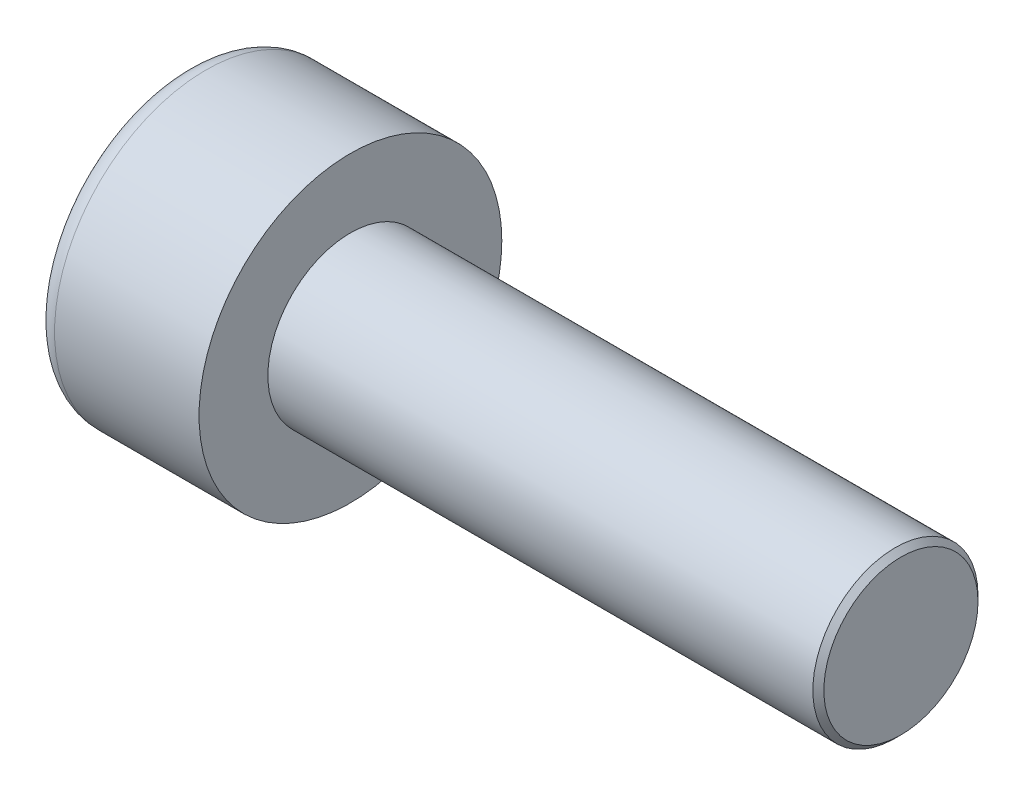
ISO-10303-21;
HEADER;
FILE_DESCRIPTION(('STEP AP214'),'2;1');
FILE_NAME('part.step','',(''),(''),'','','');
FILE_SCHEMA(('AUTOMOTIVE_DESIGN { 1 0 10303 214 1 1 1 1 }'));
ENDSEC;
DATA;
#1=APPLICATION_CONTEXT('core data for automotive mechanical design processes');
#2=APPLICATION_PROTOCOL_DEFINITION('international standard','automotive_design',2000,#1);
#3=PRODUCT_CONTEXT('',#1,'mechanical');
#4=PRODUCT('Part','Part','',(#3));
#5=PRODUCT_RELATED_PRODUCT_CATEGORY('part','',(#4));
#6=PRODUCT_DEFINITION_FORMATION('','',#4);
#7=PRODUCT_DEFINITION_CONTEXT('part definition',#1,'design');
#8=PRODUCT_DEFINITION('design','',#6,#7);
#9=PRODUCT_DEFINITION_SHAPE('','',#8);
#10=(LENGTH_UNIT() NAMED_UNIT(*) SI_UNIT(.MILLI.,.METRE.));
#11=(NAMED_UNIT(*) PLANE_ANGLE_UNIT() SI_UNIT($,.RADIAN.));
#12=(NAMED_UNIT(*) SI_UNIT($,.STERADIAN.) SOLID_ANGLE_UNIT());
#13=UNCERTAINTY_MEASURE_WITH_UNIT(LENGTH_MEASURE(1.E-05),#10,'distance_accuracy_value','');
#14=(GEOMETRIC_REPRESENTATION_CONTEXT(3) GLOBAL_UNCERTAINTY_ASSIGNED_CONTEXT((#13)) GLOBAL_UNIT_ASSIGNED_CONTEXT((#10,
#11,#12)) REPRESENTATION_CONTEXT('',''));
#15=CARTESIAN_POINT('',(0.,0.,0.));
#16=DIRECTION('',(0.,0.,1.));
#17=DIRECTION('',(1.,0.,0.));
#18=AXIS2_PLACEMENT_3D('',#15,#16,#17);
#19=CARTESIAN_POINT('',(1.3,-2.5,0.));
#20=DIRECTION('',(-1.,0.,0.));
#21=DIRECTION('',(0.,0.,1.));
#22=AXIS2_PLACEMENT_3D('',#19,#20,#21);
#23=PLANE('',#22);
#24=DIRECTION('',(0.,-0.866025403784438,-0.5));
#25=VECTOR('',#24,1.);
#26=CARTESIAN_POINT('',(1.3,0.,1.44337567297406));
#27=LINE('',#26,#25);
#28=CARTESIAN_POINT('',(1.3,-0.625,1.08253175473055));
#29=VERTEX_POINT('',#28);
#30=CARTESIAN_POINT('',(1.3,-1.25,0.721687836487032));
#31=VERTEX_POINT('',#30);
#32=EDGE_CURVE('E157',#29,#31,#27,.T.);
#33=ORIENTED_EDGE('',*,*,#32,.F.);
#34=CARTESIAN_POINT('',(1.3,0.,0.));
#35=DIRECTION('',(-1.,0.,0.));
#36=DIRECTION('',(0.,0.,1.));
#37=AXIS2_PLACEMENT_3D('',#34,#35,#36);
#38=CIRCLE('',#37,1.25);
#39=CARTESIAN_POINT('',(1.3,-1.25,0.));
#40=VERTEX_POINT('',#39);
#41=EDGE_CURVE('E52',#29,#40,#38,.F.);
#42=ORIENTED_EDGE('',*,*,#41,.T.);
#43=DIRECTION('',(0.,0.,-1.));
#44=VECTOR('',#43,1.);
#45=CARTESIAN_POINT('',(1.3,-1.25,0.721687836487032));
#46=LINE('',#45,#44);
#47=EDGE_CURVE('E162',#31,#40,#46,.T.);
#48=ORIENTED_EDGE('',*,*,#47,.F.);
#49=EDGE_LOOP('',(#33,#42,#48));
#50=FACE_BOUND('',#49,.T.);
#51=ADVANCED_FACE('F37',(#50),#23,.T.);
#52=CARTESIAN_POINT('',(1.3,-1.25,-0.721687836487033));
#53=VERTEX_POINT('',#52);
#54=EDGE_CURVE('E161',#40,#53,#46,.T.);
#55=ORIENTED_EDGE('',*,*,#54,.F.);
#56=CARTESIAN_POINT('',(1.3,-0.624999999999999,-1.08253175473055));
#57=VERTEX_POINT('',#56);
#58=EDGE_CURVE('E137',#40,#57,#38,.F.);
#59=ORIENTED_EDGE('',*,*,#58,.T.);
#60=DIRECTION('',(0.,0.866025403784438,-0.5));
#61=VECTOR('',#60,1.);
#62=CARTESIAN_POINT('',(1.3,-1.25,-0.721687836487033));
#63=LINE('',#62,#61);
#64=EDGE_CURVE('E145',#53,#57,#63,.T.);
#65=ORIENTED_EDGE('',*,*,#64,.F.);
#66=EDGE_LOOP('',(#55,#59,#65));
#67=FACE_BOUND('',#66,.T.);
#68=ADVANCED_FACE('F218',(#67),#23,.T.);
#69=CARTESIAN_POINT('',(1.3,0.,-1.44337567297406));
#70=VERTEX_POINT('',#69);
#71=EDGE_CURVE('E135',#57,#70,#63,.T.);
#72=ORIENTED_EDGE('',*,*,#71,.F.);
#73=CARTESIAN_POINT('',(1.3,0.625,-1.08253175473055));
#74=VERTEX_POINT('',#73);
#75=EDGE_CURVE('E119',#57,#74,#38,.F.);
#76=ORIENTED_EDGE('',*,*,#75,.T.);
#77=DIRECTION('',(0.,0.866025403784438,0.5));
#78=VECTOR('',#77,1.);
#79=CARTESIAN_POINT('',(1.3,0.,-1.44337567297406));
#80=LINE('',#79,#78);
#81=EDGE_CURVE('E133',#70,#74,#80,.T.);
#82=ORIENTED_EDGE('',*,*,#81,.F.);
#83=EDGE_LOOP('',(#72,#76,#82));
#84=FACE_BOUND('',#83,.T.);
#85=ADVANCED_FACE('F131',(#84),#23,.T.);
#86=CARTESIAN_POINT('',(1.3,1.25,-0.721687836487031));
#87=VERTEX_POINT('',#86);
#88=EDGE_CURVE('E139',#74,#87,#80,.T.);
#89=ORIENTED_EDGE('',*,*,#88,.F.);
#90=CARTESIAN_POINT('',(1.3,0.,0.));
#91=DIRECTION('',(1.,0.,0.));
#92=DIRECTION('',(0.,0.,-1.));
#93=AXIS2_PLACEMENT_3D('',#90,#91,#92);
#94=CIRCLE('',#93,1.25);
#95=CARTESIAN_POINT('',(1.3,1.25,0.));
#96=VERTEX_POINT('',#95);
#97=EDGE_CURVE('E117',#74,#96,#94,.T.);
#98=ORIENTED_EDGE('',*,*,#97,.T.);
#99=DIRECTION('',(0.,0.,1.));
#100=VECTOR('',#99,1.);
#101=CARTESIAN_POINT('',(1.3,1.25,-0.721687836487031));
#102=LINE('',#101,#100);
#103=EDGE_CURVE('E142',#87,#96,#102,.T.);
#104=ORIENTED_EDGE('',*,*,#103,.F.);
#105=EDGE_LOOP('',(#89,#98,#104));
#106=FACE_BOUND('',#105,.T.);
#107=ADVANCED_FACE('F140',(#106),#23,.T.);
#108=CARTESIAN_POINT('',(1.3,1.25,0.721687836487032));
#109=VERTEX_POINT('',#108);
#110=EDGE_CURVE('E149',#96,#109,#102,.T.);
#111=ORIENTED_EDGE('',*,*,#110,.F.);
#112=CARTESIAN_POINT('',(1.3,0.625,1.08253175473055));
#113=VERTEX_POINT('',#112);
#114=EDGE_CURVE('E122',#96,#113,#38,.F.);
#115=ORIENTED_EDGE('',*,*,#114,.T.);
#116=DIRECTION('',(0.,-0.866025403784439,0.5));
#117=VECTOR('',#116,1.);
#118=CARTESIAN_POINT('',(1.3,1.25,0.721687836487032));
#119=LINE('',#118,#117);
#120=EDGE_CURVE('E154',#109,#113,#119,.T.);
#121=ORIENTED_EDGE('',*,*,#120,.F.);
#122=EDGE_LOOP('',(#111,#115,#121));
#123=FACE_BOUND('',#122,.T.);
#124=ADVANCED_FACE('F230',(#123),#23,.T.);
#125=CARTESIAN_POINT('',(1.3,0.,1.44337567297406));
#126=VERTEX_POINT('',#125);
#127=EDGE_CURVE('E153',#113,#126,#119,.T.);
#128=ORIENTED_EDGE('',*,*,#127,.F.);
#129=EDGE_CURVE('E198',#113,#29,#38,.F.);
#130=ORIENTED_EDGE('',*,*,#129,.T.);
#131=EDGE_CURVE('E158',#126,#29,#27,.T.);
#132=ORIENTED_EDGE('',*,*,#131,.F.);
#133=EDGE_LOOP('',(#128,#130,#132));
#134=FACE_BOUND('',#133,.T.);
#135=ADVANCED_FACE('F221',(#134),#23,.T.);
#136=CARTESIAN_POINT('',(0.,0.,0.));
#137=DIRECTION('',(1.,0.,0.));
#138=DIRECTION('',(0.,0.,-1.));
#139=AXIS2_PLACEMENT_3D('',#136,#137,#138);
#140=PLANE('',#139);
#141=CARTESIAN_POINT('',(0.,0.,0.));
#142=DIRECTION('',(1.,0.,0.));
#143=DIRECTION('',(0.,0.,-1.));
#144=AXIS2_PLACEMENT_3D('',#141,#142,#143);
#145=CIRCLE('',#144,2.375);
#146=CARTESIAN_POINT('',(0.,0.,-2.375));
#147=VERTEX_POINT('',#146);
#148=EDGE_CURVE('E203',#147,#147,#145,.F.);
#149=ORIENTED_EDGE('',*,*,#148,.T.);
#150=EDGE_LOOP('',(#149));
#151=FACE_BOUND('',#150,.T.);
#152=DIRECTION('',(0.,0.866025403784438,-0.5));
#153=VECTOR('',#152,1.);
#154=CARTESIAN_POINT('',(0.,-1.25,-0.721687836487033));
#155=LINE('',#154,#153);
#156=CARTESIAN_POINT('',(0.,-1.25,-0.721687836487033));
#157=VERTEX_POINT('',#156);
#158=CARTESIAN_POINT('',(0.,0.,-1.44337567297406));
#159=VERTEX_POINT('',#158);
#160=EDGE_CURVE('E60',#157,#159,#155,.T.);
#161=ORIENTED_EDGE('',*,*,#160,.T.);
#162=DIRECTION('',(0.,0.866025403784438,0.5));
#163=VECTOR('',#162,1.);
#164=CARTESIAN_POINT('',(0.,0.,-1.44337567297406));
#165=LINE('',#164,#163);
#166=CARTESIAN_POINT('',(0.,1.25,-0.721687836487031));
#167=VERTEX_POINT('',#166);
#168=EDGE_CURVE('E167',#159,#167,#165,.T.);
#169=ORIENTED_EDGE('',*,*,#168,.T.);
#170=DIRECTION('',(0.,0.,1.));
#171=VECTOR('',#170,1.);
#172=CARTESIAN_POINT('',(0.,1.25,-0.721687836487031));
#173=LINE('',#172,#171);
#174=CARTESIAN_POINT('',(0.,1.25,0.721687836487032));
#175=VERTEX_POINT('',#174);
#176=EDGE_CURVE('E170',#167,#175,#173,.T.);
#177=ORIENTED_EDGE('',*,*,#176,.T.);
#178=DIRECTION('',(0.,-0.866025403784439,0.5));
#179=VECTOR('',#178,1.);
#180=CARTESIAN_POINT('',(0.,1.25,0.721687836487032));
#181=LINE('',#180,#179);
#182=CARTESIAN_POINT('',(0.,0.,1.44337567297406));
#183=VERTEX_POINT('',#182);
#184=EDGE_CURVE('E173',#175,#183,#181,.T.);
#185=ORIENTED_EDGE('',*,*,#184,.T.);
#186=DIRECTION('',(0.,-0.866025403784438,-0.5));
#187=VECTOR('',#186,1.);
#188=CARTESIAN_POINT('',(0.,0.,1.44337567297406));
#189=LINE('',#188,#187);
#190=CARTESIAN_POINT('',(0.,-1.25,0.721687836487032));
#191=VERTEX_POINT('',#190);
#192=EDGE_CURVE('E176',#183,#191,#189,.T.);
#193=ORIENTED_EDGE('',*,*,#192,.T.);
#194=DIRECTION('',(0.,0.,-1.));
#195=VECTOR('',#194,1.);
#196=CARTESIAN_POINT('',(0.,-1.25,0.721687836487032));
#197=LINE('',#196,#195);
#198=EDGE_CURVE('E179',#191,#157,#197,.T.);
#199=ORIENTED_EDGE('',*,*,#198,.T.);
#200=EDGE_LOOP('',(#161,#169,#177,#185,#193,#199));
#201=FACE_BOUND('',#200,.T.);
#202=ADVANCED_FACE('F229',(#151,#201),#140,.F.);
#203=CARTESIAN_POINT('',(3.,0.,0.));
#204=DIRECTION('',(1.,0.,0.));
#205=DIRECTION('',(0.,0.,-1.));
#206=AXIS2_PLACEMENT_3D('',#203,#204,#205);
#207=PLANE('',#206);
#208=CARTESIAN_POINT('',(3.,0.,0.));
#209=DIRECTION('',(1.,0.,0.));
#210=DIRECTION('',(0.,0.,-1.));
#211=AXIS2_PLACEMENT_3D('',#208,#209,#210);
#212=CIRCLE('',#211,2.75);
#213=CARTESIAN_POINT('',(3.,0.,-2.75));
#214=VERTEX_POINT('',#213);
#215=EDGE_CURVE('E195',#214,#214,#212,.T.);
#216=ORIENTED_EDGE('',*,*,#215,.T.);
#217=EDGE_LOOP('',(#216));
#218=FACE_BOUND('',#217,.T.);
#219=CARTESIAN_POINT('',(3.,0.,0.));
#220=DIRECTION('',(1.,0.,0.));
#221=DIRECTION('',(0.,0.,-1.));
#222=AXIS2_PLACEMENT_3D('',#219,#220,#221);
#223=CIRCLE('',#222,1.5);
#224=CARTESIAN_POINT('',(3.,0.,-1.5));
#225=VERTEX_POINT('',#224);
#226=EDGE_CURVE('E192',#225,#225,#223,.T.);
#227=ORIENTED_EDGE('',*,*,#226,.F.);
#228=EDGE_LOOP('',(#227));
#229=FACE_BOUND('',#228,.T.);
#230=ADVANCED_FACE('F236',(#218,#229),#207,.T.);
#231=CARTESIAN_POINT('',(3.,0.,0.));
#232=DIRECTION('',(-1.,0.,0.));
#233=DIRECTION('',(0.,0.,1.));
#234=AXIS2_PLACEMENT_3D('',#231,#232,#233);
#235=CYLINDRICAL_SURFACE('',#234,2.75);
#236=CARTESIAN_POINT('',(0.375,0.,0.));
#237=DIRECTION('',(1.,0.,0.));
#238=DIRECTION('',(0.,0.,-1.));
#239=AXIS2_PLACEMENT_3D('',#236,#237,#238);
#240=CIRCLE('',#239,2.75);
#241=CARTESIAN_POINT('',(0.375,0.,-2.75));
#242=VERTEX_POINT('',#241);
#243=EDGE_CURVE('E200',#242,#242,#240,.T.);
#244=ORIENTED_EDGE('',*,*,#243,.T.);
#245=EDGE_LOOP('',(#244));
#246=FACE_BOUND('',#245,.T.);
#247=ORIENTED_EDGE('',*,*,#215,.F.);
#248=EDGE_LOOP('',(#247));
#249=FACE_BOUND('',#248,.T.);
#250=ADVANCED_FACE('F281',(#246,#249),#235,.T.);
#251=CARTESIAN_POINT('',(13.,0.,0.));
#252=DIRECTION('',(-1.,0.,0.));
#253=DIRECTION('',(0.,0.,1.));
#254=AXIS2_PLACEMENT_3D('',#251,#252,#253);
#255=CYLINDRICAL_SURFACE('',#254,1.5);
#256=CARTESIAN_POINT('',(12.9,0.,0.));
#257=DIRECTION('',(1.,0.,0.));
#258=DIRECTION('',(0.,0.,-1.));
#259=AXIS2_PLACEMENT_3D('',#256,#257,#258);
#260=CIRCLE('',#259,1.5);
#261=CARTESIAN_POINT('',(12.9,0.,-1.5));
#262=VERTEX_POINT('',#261);
#263=EDGE_CURVE('E11',#262,#262,#260,.F.);
#264=ORIENTED_EDGE('',*,*,#263,.T.);
#265=EDGE_LOOP('',(#264));
#266=FACE_BOUND('',#265,.T.);
#267=ORIENTED_EDGE('',*,*,#226,.T.);
#268=EDGE_LOOP('',(#267));
#269=FACE_BOUND('',#268,.T.);
#270=ADVANCED_FACE('F278',(#266,#269),#255,.T.);
#271=CARTESIAN_POINT('',(13.,0.,0.));
#272=DIRECTION('',(1.,0.,0.));
#273=DIRECTION('',(0.,0.,-1.));
#274=AXIS2_PLACEMENT_3D('',#271,#272,#273);
#275=PLANE('',#274);
#276=CARTESIAN_POINT('',(13.,0.,0.));
#277=DIRECTION('',(1.,0.,0.));
#278=DIRECTION('',(0.,0.,-1.));
#279=AXIS2_PLACEMENT_3D('',#276,#277,#278);
#280=CIRCLE('',#279,1.4);
#281=CARTESIAN_POINT('',(13.,0.,-1.4));
#282=VERTEX_POINT('',#281);
#283=EDGE_CURVE('E45',#282,#282,#280,.T.);
#284=ORIENTED_EDGE('',*,*,#283,.T.);
#285=EDGE_LOOP('',(#284));
#286=FACE_BOUND('',#285,.T.);
#287=ADVANCED_FACE('F208',(#286),#275,.T.);
#288=CARTESIAN_POINT('',(1.3,-1.25,-0.721687836487033));
#289=DIRECTION('',(0.,0.5,0.866025403784439));
#290=DIRECTION('',(0.,-0.866025403784439,0.5));
#291=AXIS2_PLACEMENT_3D('',#288,#289,#290);
#292=PLANE('',#291);
#293=ORIENTED_EDGE('',*,*,#160,.F.);
#294=DIRECTION('',(-1.,0.,0.));
#295=VECTOR('',#294,1.);
#296=CARTESIAN_POINT('',(1.3,-1.25,-0.721687836487033));
#297=LINE('',#296,#295);
#298=EDGE_CURVE('E165',#53,#157,#297,.T.);
#299=ORIENTED_EDGE('',*,*,#298,.F.);
#300=ORIENTED_EDGE('',*,*,#64,.T.);
#301=ORIENTED_EDGE('',*,*,#71,.T.);
#302=DIRECTION('',(-1.,0.,0.));
#303=VECTOR('',#302,1.);
#304=CARTESIAN_POINT('',(1.3,0.,-1.44337567297406));
#305=LINE('',#304,#303);
#306=EDGE_CURVE('E148',#70,#159,#305,.T.);
#307=ORIENTED_EDGE('',*,*,#306,.T.);
#308=EDGE_LOOP('',(#293,#299,#300,#301,#307));
#309=FACE_BOUND('',#308,.T.);
#310=ADVANCED_FACE('F252',(#309),#292,.T.);
#311=CARTESIAN_POINT('',(1.3,0.,-1.44337567297406));
#312=DIRECTION('',(0.,-0.5,0.866025403784438));
#313=DIRECTION('',(0.,-0.866025403784438,-0.5));
#314=AXIS2_PLACEMENT_3D('',#311,#312,#313);
#315=PLANE('',#314);
#316=ORIENTED_EDGE('',*,*,#168,.F.);
#317=ORIENTED_EDGE('',*,*,#306,.F.);
#318=ORIENTED_EDGE('',*,*,#81,.T.);
#319=ORIENTED_EDGE('',*,*,#88,.T.);
#320=DIRECTION('',(-1.,0.,0.));
#321=VECTOR('',#320,1.);
#322=CARTESIAN_POINT('',(1.3,1.25,-0.721687836487031));
#323=LINE('',#322,#321);
#324=EDGE_CURVE('E189',#87,#167,#323,.T.);
#325=ORIENTED_EDGE('',*,*,#324,.T.);
#326=EDGE_LOOP('',(#316,#317,#318,#319,#325));
#327=FACE_BOUND('',#326,.T.);
#328=ADVANCED_FACE('F147',(#327),#315,.T.);
#329=CARTESIAN_POINT('',(1.3,1.25,-0.721687836487031));
#330=DIRECTION('',(0.,-1.,0.));
#331=DIRECTION('',(0.,0.,-1.));
#332=AXIS2_PLACEMENT_3D('',#329,#330,#331);
#333=PLANE('',#332);
#334=ORIENTED_EDGE('',*,*,#176,.F.);
#335=ORIENTED_EDGE('',*,*,#324,.F.);
#336=ORIENTED_EDGE('',*,*,#103,.T.);
#337=ORIENTED_EDGE('',*,*,#110,.T.);
#338=DIRECTION('',(-1.,0.,0.));
#339=VECTOR('',#338,1.);
#340=CARTESIAN_POINT('',(1.3,1.25,0.721687836487032));
#341=LINE('',#340,#339);
#342=EDGE_CURVE('E187',#109,#175,#341,.T.);
#343=ORIENTED_EDGE('',*,*,#342,.T.);
#344=EDGE_LOOP('',(#334,#335,#336,#337,#343));
#345=FACE_BOUND('',#344,.T.);
#346=ADVANCED_FACE('F250',(#345),#333,.T.);
#347=CARTESIAN_POINT('',(1.3,1.25,0.721687836487032));
#348=DIRECTION('',(0.,-0.5,-0.866025403784439));
#349=DIRECTION('',(0.,0.866025403784439,-0.5));
#350=AXIS2_PLACEMENT_3D('',#347,#348,#349);
#351=PLANE('',#350);
#352=ORIENTED_EDGE('',*,*,#184,.F.);
#353=ORIENTED_EDGE('',*,*,#342,.F.);
#354=ORIENTED_EDGE('',*,*,#120,.T.);
#355=ORIENTED_EDGE('',*,*,#127,.T.);
#356=DIRECTION('',(-1.,0.,0.));
#357=VECTOR('',#356,1.);
#358=CARTESIAN_POINT('',(1.3,0.,1.44337567297406));
#359=LINE('',#358,#357);
#360=EDGE_CURVE('E185',#126,#183,#359,.T.);
#361=ORIENTED_EDGE('',*,*,#360,.T.);
#362=EDGE_LOOP('',(#352,#353,#354,#355,#361));
#363=FACE_BOUND('',#362,.T.);
#364=ADVANCED_FACE('F247',(#363),#351,.T.);
#365=CARTESIAN_POINT('',(1.3,0.,1.44337567297406));
#366=DIRECTION('',(0.,0.5,-0.866025403784438));
#367=DIRECTION('',(0.,0.866025403784438,0.5));
#368=AXIS2_PLACEMENT_3D('',#365,#366,#367);
#369=PLANE('',#368);
#370=ORIENTED_EDGE('',*,*,#192,.F.);
#371=ORIENTED_EDGE('',*,*,#360,.F.);
#372=ORIENTED_EDGE('',*,*,#131,.T.);
#373=ORIENTED_EDGE('',*,*,#32,.T.);
#374=DIRECTION('',(-1.,0.,0.));
#375=VECTOR('',#374,1.);
#376=CARTESIAN_POINT('',(1.3,-1.25,0.721687836487032));
#377=LINE('',#376,#375);
#378=EDGE_CURVE('E183',#31,#191,#377,.T.);
#379=ORIENTED_EDGE('',*,*,#378,.T.);
#380=EDGE_LOOP('',(#370,#371,#372,#373,#379));
#381=FACE_BOUND('',#380,.T.);
#382=ADVANCED_FACE('F261',(#381),#369,.T.);
#383=CARTESIAN_POINT('',(1.3,-1.25,0.721687836487032));
#384=DIRECTION('',(0.,1.,0.));
#385=DIRECTION('',(0.,0.,1.));
#386=AXIS2_PLACEMENT_3D('',#383,#384,#385);
#387=PLANE('',#386);
#388=ORIENTED_EDGE('',*,*,#198,.F.);
#389=ORIENTED_EDGE('',*,*,#378,.F.);
#390=ORIENTED_EDGE('',*,*,#47,.T.);
#391=ORIENTED_EDGE('',*,*,#54,.T.);
#392=ORIENTED_EDGE('',*,*,#298,.T.);
#393=EDGE_LOOP('',(#388,#389,#390,#391,#392));
#394=FACE_BOUND('',#393,.T.);
#395=ADVANCED_FACE('F114',(#394),#387,.T.);
#396=CARTESIAN_POINT('',(1.3,0.,0.));
#397=DIRECTION('',(-1.,0.,0.));
#398=DIRECTION('',(0.,0.,1.));
#399=AXIS2_PLACEMENT_3D('',#396,#397,#398);
#400=CONICAL_SURFACE('',#399,1.25,1.04719755119659);
#401=CARTESIAN_POINT('',(2.02168783648704,0.,0.));
#402=VERTEX_POINT('',#401);
#403=VERTEX_LOOP('',#402);
#404=FACE_BOUND('',#403,.T.);
#405=ORIENTED_EDGE('',*,*,#97,.F.);
#406=ORIENTED_EDGE('',*,*,#75,.F.);
#407=ORIENTED_EDGE('',*,*,#58,.F.);
#408=ORIENTED_EDGE('',*,*,#41,.F.);
#409=ORIENTED_EDGE('',*,*,#129,.F.);
#410=ORIENTED_EDGE('',*,*,#114,.F.);
#411=EDGE_LOOP('',(#405,#406,#407,#408,#409,#410));
#412=FACE_BOUND('',#411,.T.);
#413=ADVANCED_FACE('F111',(#404,#412),#400,.F.);
#414=CARTESIAN_POINT('',(0.375,0.,0.));
#415=DIRECTION('',(1.,0.,0.));
#416=DIRECTION('',(0.,0.,-1.));
#417=AXIS2_PLACEMENT_3D('',#414,#415,#416);
#418=TOROIDAL_SURFACE('',#417,2.375,0.375);
#419=ORIENTED_EDGE('',*,*,#148,.F.);
#420=EDGE_LOOP('',(#419));
#421=FACE_BOUND('',#420,.T.);
#422=ORIENTED_EDGE('',*,*,#243,.F.);
#423=EDGE_LOOP('',(#422));
#424=FACE_BOUND('',#423,.T.);
#425=ADVANCED_FACE('F113',(#421,#424),#418,.T.);
#426=CARTESIAN_POINT('',(13.,0.,0.));
#427=DIRECTION('',(-1.,0.,0.));
#428=DIRECTION('',(0.,0.,1.));
#429=AXIS2_PLACEMENT_3D('',#426,#427,#428);
#430=CONICAL_SURFACE('',#429,1.4,0.785398163397451);
#431=ORIENTED_EDGE('',*,*,#263,.F.);
#432=EDGE_LOOP('',(#431));
#433=FACE_BOUND('',#432,.T.);
#434=ORIENTED_EDGE('',*,*,#283,.F.);
#435=EDGE_LOOP('',(#434));
#436=FACE_BOUND('',#435,.T.);
#437=ADVANCED_FACE('F39',(#433,#436),#430,.T.);
#438=CLOSED_SHELL('',(#51,#68,#85,#107,#124,#135,#202,#230,#250,#270,#287,#310,#328,#346,#364,
#382,#395,#413,#425,#437));
#439=MANIFOLD_SOLID_BREP('B2',#438);
#440=ADVANCED_BREP_SHAPE_REPRESENTATION('',(#18,#439),#14);
#441=SHAPE_DEFINITION_REPRESENTATION(#9,#440);
ENDSEC;
END-ISO-10303-21;
